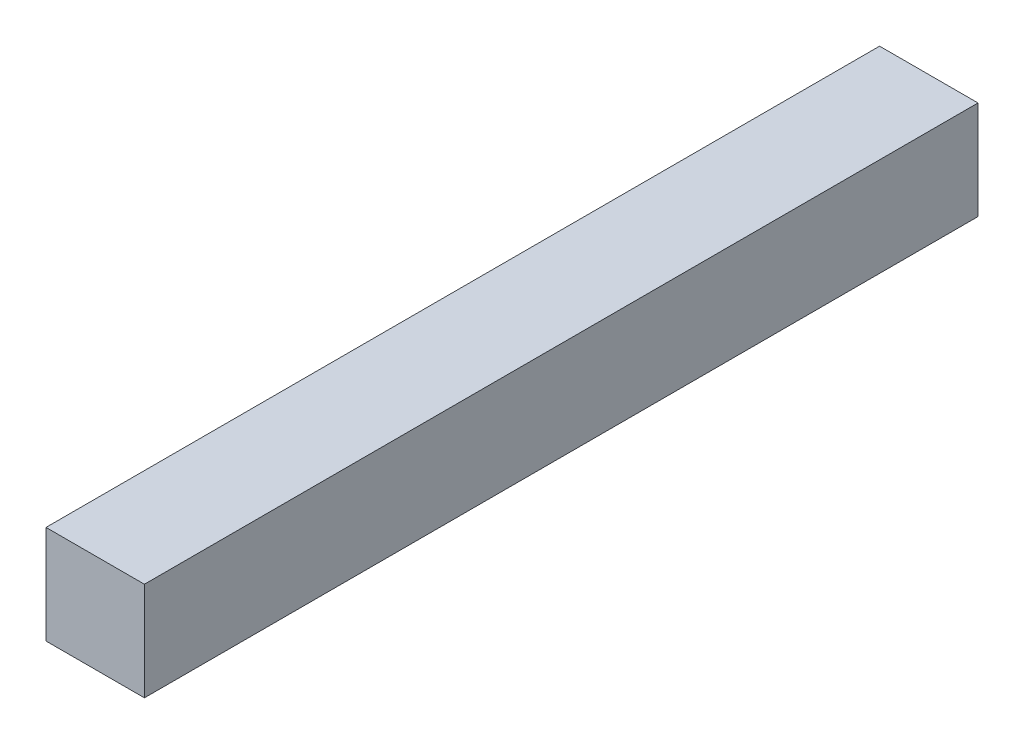
ISO-10303-21;
HEADER;
FILE_DESCRIPTION(('STEP AP214'),'2;1');
FILE_NAME('part.step','',(''),(''),'','','');
FILE_SCHEMA(('AUTOMOTIVE_DESIGN { 1 0 10303 214 1 1 1 1 }'));
ENDSEC;
DATA;
#1=APPLICATION_CONTEXT('core data for automotive mechanical design processes');
#2=APPLICATION_PROTOCOL_DEFINITION('international standard','automotive_design',2000,#1);
#3=PRODUCT_CONTEXT('',#1,'mechanical');
#4=PRODUCT('Part','Part','',(#3));
#5=PRODUCT_RELATED_PRODUCT_CATEGORY('part','',(#4));
#6=PRODUCT_DEFINITION_FORMATION('','',#4);
#7=PRODUCT_DEFINITION_CONTEXT('part definition',#1,'design');
#8=PRODUCT_DEFINITION('design','',#6,#7);
#9=PRODUCT_DEFINITION_SHAPE('','',#8);
#10=(LENGTH_UNIT() NAMED_UNIT(*) SI_UNIT(.MILLI.,.METRE.));
#11=(NAMED_UNIT(*) PLANE_ANGLE_UNIT() SI_UNIT($,.RADIAN.));
#12=(NAMED_UNIT(*) SI_UNIT($,.STERADIAN.) SOLID_ANGLE_UNIT());
#13=UNCERTAINTY_MEASURE_WITH_UNIT(LENGTH_MEASURE(1.E-05),#10,'distance_accuracy_value','');
#14=(GEOMETRIC_REPRESENTATION_CONTEXT(3) GLOBAL_UNCERTAINTY_ASSIGNED_CONTEXT((#13)) GLOBAL_UNIT_ASSIGNED_CONTEXT((#10,
#11,#12)) REPRESENTATION_CONTEXT('',''));
#15=CARTESIAN_POINT('',(0.,0.,0.));
#16=DIRECTION('',(0.,0.,1.));
#17=DIRECTION('',(1.,0.,0.));
#18=AXIS2_PLACEMENT_3D('',#15,#16,#17);
#19=CARTESIAN_POINT('',(0.,0.,25.41));
#20=DIRECTION('',(1.,0.,0.));
#21=DIRECTION('',(0.,0.,-1.));
#22=AXIS2_PLACEMENT_3D('',#19,#20,#21);
#23=PLANE('',#22);
#24=DIRECTION('',(0.,-1.,0.));
#25=VECTOR('',#24,1.);
#26=CARTESIAN_POINT('',(0.,0.,0.));
#27=LINE('',#26,#25);
#28=CARTESIAN_POINT('',(0.,3.,0.));
#29=VERTEX_POINT('',#28);
#30=CARTESIAN_POINT('',(0.,0.,0.));
#31=VERTEX_POINT('',#30);
#32=EDGE_CURVE('E107',#29,#31,#27,.T.);
#33=ORIENTED_EDGE('',*,*,#32,.T.);
#34=DIRECTION('',(0.,0.,-1.));
#35=VECTOR('',#34,1.);
#36=CARTESIAN_POINT('',(0.,0.,25.41));
#37=LINE('',#36,#35);
#38=CARTESIAN_POINT('',(0.,0.,25.41));
#39=VERTEX_POINT('',#38);
#40=EDGE_CURVE('E11',#39,#31,#37,.T.);
#41=ORIENTED_EDGE('',*,*,#40,.F.);
#42=DIRECTION('',(0.,-1.,0.));
#43=VECTOR('',#42,1.);
#44=CARTESIAN_POINT('',(0.,0.,25.41));
#45=LINE('',#44,#43);
#46=CARTESIAN_POINT('',(0.,3.,25.41));
#47=VERTEX_POINT('',#46);
#48=EDGE_CURVE('E91',#47,#39,#45,.T.);
#49=ORIENTED_EDGE('',*,*,#48,.F.);
#50=DIRECTION('',(0.,0.,-1.));
#51=VECTOR('',#50,1.);
#52=CARTESIAN_POINT('',(0.,3.,25.41));
#53=LINE('',#52,#51);
#54=EDGE_CURVE('E103',#47,#29,#53,.T.);
#55=ORIENTED_EDGE('',*,*,#54,.T.);
#56=EDGE_LOOP('',(#33,#41,#49,#55));
#57=FACE_BOUND('',#56,.T.);
#58=ADVANCED_FACE('F39',(#57),#23,.F.);
#59=CARTESIAN_POINT('',(0.,0.,25.41));
#60=DIRECTION('',(0.,1.,0.));
#61=DIRECTION('',(0.,0.,1.));
#62=AXIS2_PLACEMENT_3D('',#59,#60,#61);
#63=PLANE('',#62);
#64=DIRECTION('',(1.,0.,0.));
#65=VECTOR('',#64,1.);
#66=CARTESIAN_POINT('',(0.,0.,0.));
#67=LINE('',#66,#65);
#68=CARTESIAN_POINT('',(3.,0.,0.));
#69=VERTEX_POINT('',#68);
#70=EDGE_CURVE('E96',#31,#69,#67,.T.);
#71=ORIENTED_EDGE('',*,*,#70,.T.);
#72=DIRECTION('',(0.,0.,-1.));
#73=VECTOR('',#72,1.);
#74=CARTESIAN_POINT('',(3.,0.,25.41));
#75=LINE('',#74,#73);
#76=CARTESIAN_POINT('',(3.,0.,25.41));
#77=VERTEX_POINT('',#76);
#78=EDGE_CURVE('E48',#77,#69,#75,.T.);
#79=ORIENTED_EDGE('',*,*,#78,.F.);
#80=DIRECTION('',(1.,0.,0.));
#81=VECTOR('',#80,1.);
#82=CARTESIAN_POINT('',(0.,0.,25.41));
#83=LINE('',#82,#81);
#84=EDGE_CURVE('E86',#39,#77,#83,.T.);
#85=ORIENTED_EDGE('',*,*,#84,.F.);
#86=ORIENTED_EDGE('',*,*,#40,.T.);
#87=EDGE_LOOP('',(#71,#79,#85,#86));
#88=FACE_BOUND('',#87,.T.);
#89=ADVANCED_FACE('F95',(#88),#63,.F.);
#90=CARTESIAN_POINT('',(3.,0.,25.41));
#91=DIRECTION('',(-1.,0.,0.));
#92=DIRECTION('',(0.,0.,1.));
#93=AXIS2_PLACEMENT_3D('',#90,#91,#92);
#94=PLANE('',#93);
#95=DIRECTION('',(0.,1.,0.));
#96=VECTOR('',#95,1.);
#97=CARTESIAN_POINT('',(3.,0.,0.));
#98=LINE('',#97,#96);
#99=CARTESIAN_POINT('',(3.,3.,0.));
#100=VERTEX_POINT('',#99);
#101=EDGE_CURVE('E73',#69,#100,#98,.T.);
#102=ORIENTED_EDGE('',*,*,#101,.T.);
#103=DIRECTION('',(0.,0.,-1.));
#104=VECTOR('',#103,1.);
#105=CARTESIAN_POINT('',(3.,3.,25.41));
#106=LINE('',#105,#104);
#107=CARTESIAN_POINT('',(3.,3.,25.41));
#108=VERTEX_POINT('',#107);
#109=EDGE_CURVE('E98',#108,#100,#106,.T.);
#110=ORIENTED_EDGE('',*,*,#109,.F.);
#111=DIRECTION('',(0.,1.,0.));
#112=VECTOR('',#111,1.);
#113=CARTESIAN_POINT('',(3.,0.,25.41));
#114=LINE('',#113,#112);
#115=EDGE_CURVE('E89',#77,#108,#114,.T.);
#116=ORIENTED_EDGE('',*,*,#115,.F.);
#117=ORIENTED_EDGE('',*,*,#78,.T.);
#118=EDGE_LOOP('',(#102,#110,#116,#117));
#119=FACE_BOUND('',#118,.T.);
#120=ADVANCED_FACE('F99',(#119),#94,.F.);
#121=CARTESIAN_POINT('',(0.,3.,25.41));
#122=DIRECTION('',(0.,-1.,0.));
#123=DIRECTION('',(0.,0.,-1.));
#124=AXIS2_PLACEMENT_3D('',#121,#122,#123);
#125=PLANE('',#124);
#126=DIRECTION('',(-1.,0.,0.));
#127=VECTOR('',#126,1.);
#128=CARTESIAN_POINT('',(0.,3.,0.));
#129=LINE('',#128,#127);
#130=EDGE_CURVE('E79',#100,#29,#129,.T.);
#131=ORIENTED_EDGE('',*,*,#130,.T.);
#132=ORIENTED_EDGE('',*,*,#54,.F.);
#133=DIRECTION('',(-1.,0.,0.));
#134=VECTOR('',#133,1.);
#135=CARTESIAN_POINT('',(0.,3.,25.41));
#136=LINE('',#135,#134);
#137=EDGE_CURVE('E56',#108,#47,#136,.T.);
#138=ORIENTED_EDGE('',*,*,#137,.F.);
#139=ORIENTED_EDGE('',*,*,#109,.T.);
#140=EDGE_LOOP('',(#131,#132,#138,#139));
#141=FACE_BOUND('',#140,.T.);
#142=ADVANCED_FACE('F120',(#141),#125,.F.);
#143=CARTESIAN_POINT('',(0.,0.,25.41));
#144=DIRECTION('',(0.,0.,-1.));
#145=DIRECTION('',(-1.,0.,0.));
#146=AXIS2_PLACEMENT_3D('',#143,#144,#145);
#147=PLANE('',#146);
#148=ORIENTED_EDGE('',*,*,#48,.T.);
#149=ORIENTED_EDGE('',*,*,#84,.T.);
#150=ORIENTED_EDGE('',*,*,#115,.T.);
#151=ORIENTED_EDGE('',*,*,#137,.T.);
#152=EDGE_LOOP('',(#148,#149,#150,#151));
#153=FACE_BOUND('',#152,.T.);
#154=ADVANCED_FACE('F87',(#153),#147,.F.);
#155=CARTESIAN_POINT('',(0.,0.,0.));
#156=DIRECTION('',(0.,0.,-1.));
#157=DIRECTION('',(-1.,0.,0.));
#158=AXIS2_PLACEMENT_3D('',#155,#156,#157);
#159=PLANE('',#158);
#160=ORIENTED_EDGE('',*,*,#32,.F.);
#161=ORIENTED_EDGE('',*,*,#130,.F.);
#162=ORIENTED_EDGE('',*,*,#101,.F.);
#163=ORIENTED_EDGE('',*,*,#70,.F.);
#164=EDGE_LOOP('',(#160,#161,#162,#163));
#165=FACE_BOUND('',#164,.T.);
#166=ADVANCED_FACE('F123',(#165),#159,.T.);
#167=CLOSED_SHELL('',(#58,#89,#120,#142,#154,#166));
#168=MANIFOLD_SOLID_BREP('B2',#167);
#169=ADVANCED_BREP_SHAPE_REPRESENTATION('',(#18,#168),#14);
#170=SHAPE_DEFINITION_REPRESENTATION(#9,#169);
ENDSEC;
END-ISO-10303-21;
